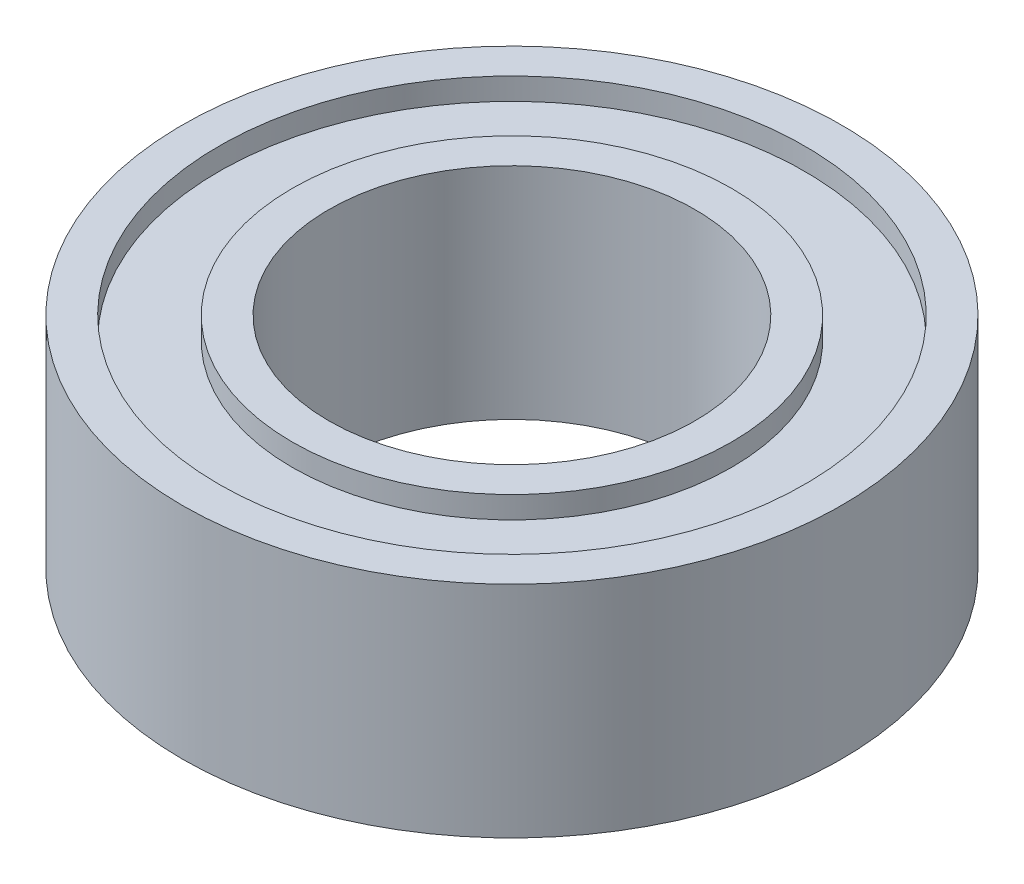
ISO-10303-21;
HEADER;
FILE_DESCRIPTION(('STEP AP214'),'2;1');
FILE_NAME('part.step','',(''),(''),'','','');
FILE_SCHEMA(('AUTOMOTIVE_DESIGN { 1 0 10303 214 1 1 1 1 }'));
ENDSEC;
DATA;
#1=APPLICATION_CONTEXT('core data for automotive mechanical design processes');
#2=APPLICATION_PROTOCOL_DEFINITION('international standard','automotive_design',2000,#1);
#3=PRODUCT_CONTEXT('',#1,'mechanical');
#4=PRODUCT('Part','Part','',(#3));
#5=PRODUCT_RELATED_PRODUCT_CATEGORY('part','',(#4));
#6=PRODUCT_DEFINITION_FORMATION('','',#4);
#7=PRODUCT_DEFINITION_CONTEXT('part definition',#1,'design');
#8=PRODUCT_DEFINITION('design','',#6,#7);
#9=PRODUCT_DEFINITION_SHAPE('','',#8);
#10=(LENGTH_UNIT() NAMED_UNIT(*) SI_UNIT(.MILLI.,.METRE.));
#11=(NAMED_UNIT(*) PLANE_ANGLE_UNIT() SI_UNIT($,.RADIAN.));
#12=(NAMED_UNIT(*) SI_UNIT($,.STERADIAN.) SOLID_ANGLE_UNIT());
#13=UNCERTAINTY_MEASURE_WITH_UNIT(LENGTH_MEASURE(1.E-05),#10,'distance_accuracy_value','');
#14=(GEOMETRIC_REPRESENTATION_CONTEXT(3) GLOBAL_UNCERTAINTY_ASSIGNED_CONTEXT((#13)) GLOBAL_UNIT_ASSIGNED_CONTEXT((#10,
#11,#12)) REPRESENTATION_CONTEXT('',''));
#15=CARTESIAN_POINT('',(0.,0.,0.));
#16=DIRECTION('',(0.,0.,1.));
#17=DIRECTION('',(1.,0.,0.));
#18=AXIS2_PLACEMENT_3D('',#15,#16,#17);
#19=CARTESIAN_POINT('',(0.,-1.5,0.));
#20=DIRECTION('',(0.,1.,0.));
#21=DIRECTION('',(0.,0.,1.));
#22=AXIS2_PLACEMENT_3D('',#19,#20,#21);
#23=CYLINDRICAL_SURFACE('',#22,4.);
#24=CARTESIAN_POINT('',(0.,-1.5,0.));
#25=DIRECTION('',(0.,1.,0.));
#26=DIRECTION('',(0.,0.,1.));
#27=AXIS2_PLACEMENT_3D('',#24,#25,#26);
#28=CIRCLE('',#27,4.);
#29=CARTESIAN_POINT('',(0.,-1.5,4.));
#30=VERTEX_POINT('',#29);
#31=EDGE_CURVE('E60',#30,#30,#28,.T.);
#32=ORIENTED_EDGE('',*,*,#31,.F.);
#33=EDGE_LOOP('',(#32));
#34=FACE_BOUND('',#33,.T.);
#35=CARTESIAN_POINT('',(0.,-1.2,0.));
#36=DIRECTION('',(0.,1.,0.));
#37=DIRECTION('',(0.,0.,1.));
#38=AXIS2_PLACEMENT_3D('',#35,#36,#37);
#39=CIRCLE('',#38,4.);
#40=CARTESIAN_POINT('',(0.,-1.2,4.));
#41=VERTEX_POINT('',#40);
#42=EDGE_CURVE('E11',#41,#41,#39,.F.);
#43=ORIENTED_EDGE('',*,*,#42,.F.);
#44=EDGE_LOOP('',(#43));
#45=FACE_BOUND('',#44,.T.);
#46=ADVANCED_FACE('F49',(#34,#45),#23,.F.);
#47=CARTESIAN_POINT('',(0.,1.2,0.));
#48=DIRECTION('',(0.,1.,0.));
#49=DIRECTION('',(0.,0.,1.));
#50=AXIS2_PLACEMENT_3D('',#47,#48,#49);
#51=CIRCLE('',#50,4.);
#52=CARTESIAN_POINT('',(0.,1.2,4.));
#53=VERTEX_POINT('',#52);
#54=EDGE_CURVE('E72',#53,#53,#51,.T.);
#55=ORIENTED_EDGE('',*,*,#54,.F.);
#56=EDGE_LOOP('',(#55));
#57=FACE_BOUND('',#56,.T.);
#58=CARTESIAN_POINT('',(0.,1.5,0.));
#59=DIRECTION('',(0.,1.,0.));
#60=DIRECTION('',(0.,0.,1.));
#61=AXIS2_PLACEMENT_3D('',#58,#59,#60);
#62=CIRCLE('',#61,4.);
#63=CARTESIAN_POINT('',(0.,1.5,4.));
#64=VERTEX_POINT('',#63);
#65=EDGE_CURVE('E69',#64,#64,#62,.T.);
#66=ORIENTED_EDGE('',*,*,#65,.T.);
#67=EDGE_LOOP('',(#66));
#68=FACE_BOUND('',#67,.T.);
#69=ADVANCED_FACE('F51',(#57,#68),#23,.F.);
#70=CARTESIAN_POINT('',(0.,-1.5,0.));
#71=DIRECTION('',(0.,1.,0.));
#72=DIRECTION('',(0.,0.,1.));
#73=AXIS2_PLACEMENT_3D('',#70,#71,#72);
#74=CYLINDRICAL_SURFACE('',#73,4.5);
#75=CARTESIAN_POINT('',(0.,-1.5,0.));
#76=DIRECTION('',(0.,1.,0.));
#77=DIRECTION('',(0.,0.,1.));
#78=AXIS2_PLACEMENT_3D('',#75,#76,#77);
#79=CIRCLE('',#78,4.5);
#80=CARTESIAN_POINT('',(0.,-1.5,4.5));
#81=VERTEX_POINT('',#80);
#82=EDGE_CURVE('E56',#81,#81,#79,.T.);
#83=ORIENTED_EDGE('',*,*,#82,.T.);
#84=EDGE_LOOP('',(#83));
#85=FACE_BOUND('',#84,.T.);
#86=CARTESIAN_POINT('',(0.,1.5,0.));
#87=DIRECTION('',(0.,1.,0.));
#88=DIRECTION('',(0.,0.,1.));
#89=AXIS2_PLACEMENT_3D('',#86,#87,#88);
#90=CIRCLE('',#89,4.5);
#91=CARTESIAN_POINT('',(0.,1.5,4.5));
#92=VERTEX_POINT('',#91);
#93=EDGE_CURVE('E64',#92,#92,#90,.T.);
#94=ORIENTED_EDGE('',*,*,#93,.F.);
#95=EDGE_LOOP('',(#94));
#96=FACE_BOUND('',#95,.T.);
#97=ADVANCED_FACE('F124',(#85,#96),#74,.T.);
#98=CARTESIAN_POINT('',(0.,-1.5,0.));
#99=DIRECTION('',(0.,1.,0.));
#100=DIRECTION('',(0.,0.,1.));
#101=AXIS2_PLACEMENT_3D('',#98,#99,#100);
#102=PLANE('',#101);
#103=ORIENTED_EDGE('',*,*,#31,.T.);
#104=EDGE_LOOP('',(#103));
#105=FACE_BOUND('',#104,.T.);
#106=ORIENTED_EDGE('',*,*,#82,.F.);
#107=EDGE_LOOP('',(#106));
#108=FACE_BOUND('',#107,.T.);
#109=ADVANCED_FACE('F129',(#105,#108),#102,.F.);
#110=CARTESIAN_POINT('',(0.,1.5,0.));
#111=DIRECTION('',(0.,1.,0.));
#112=DIRECTION('',(0.,0.,1.));
#113=AXIS2_PLACEMENT_3D('',#110,#111,#112);
#114=PLANE('',#113);
#115=ORIENTED_EDGE('',*,*,#65,.F.);
#116=EDGE_LOOP('',(#115));
#117=FACE_BOUND('',#116,.T.);
#118=ORIENTED_EDGE('',*,*,#93,.T.);
#119=EDGE_LOOP('',(#118));
#120=FACE_BOUND('',#119,.T.);
#121=ADVANCED_FACE('F132',(#117,#120),#114,.T.);
#122=CARTESIAN_POINT('',(0.,-1.2,0.));
#123=DIRECTION('',(0.,1.,0.));
#124=DIRECTION('',(0.,0.,1.));
#125=AXIS2_PLACEMENT_3D('',#122,#123,#124);
#126=PLANE('',#125);
#127=CARTESIAN_POINT('',(0.,-1.2,0.));
#128=DIRECTION('',(0.,1.,0.));
#129=DIRECTION('',(0.,0.,1.));
#130=AXIS2_PLACEMENT_3D('',#127,#128,#129);
#131=CIRCLE('',#130,3.);
#132=CARTESIAN_POINT('',(0.,-1.2,3.));
#133=VERTEX_POINT('',#132);
#134=EDGE_CURVE('E78',#133,#133,#131,.T.);
#135=ORIENTED_EDGE('',*,*,#134,.T.);
#136=EDGE_LOOP('',(#135));
#137=FACE_BOUND('',#136,.T.);
#138=ORIENTED_EDGE('',*,*,#42,.T.);
#139=EDGE_LOOP('',(#138));
#140=FACE_BOUND('',#139,.T.);
#141=ADVANCED_FACE('F138',(#137,#140),#126,.F.);
#142=CARTESIAN_POINT('',(0.,1.2,0.));
#143=DIRECTION('',(0.,1.,0.));
#144=DIRECTION('',(0.,0.,1.));
#145=AXIS2_PLACEMENT_3D('',#142,#143,#144);
#146=PLANE('',#145);
#147=ORIENTED_EDGE('',*,*,#54,.T.);
#148=EDGE_LOOP('',(#147));
#149=FACE_BOUND('',#148,.T.);
#150=CARTESIAN_POINT('',(0.,1.2,0.));
#151=DIRECTION('',(0.,1.,0.));
#152=DIRECTION('',(0.,0.,1.));
#153=AXIS2_PLACEMENT_3D('',#150,#151,#152);
#154=CIRCLE('',#153,3.);
#155=CARTESIAN_POINT('',(0.,1.2,3.));
#156=VERTEX_POINT('',#155);
#157=EDGE_CURVE('E75',#156,#156,#154,.T.);
#158=ORIENTED_EDGE('',*,*,#157,.F.);
#159=EDGE_LOOP('',(#158));
#160=FACE_BOUND('',#159,.T.);
#161=ADVANCED_FACE('F117',(#149,#160),#146,.T.);
#162=CARTESIAN_POINT('',(0.,-1.5,0.));
#163=DIRECTION('',(0.,1.,0.));
#164=DIRECTION('',(0.,0.,1.));
#165=AXIS2_PLACEMENT_3D('',#162,#163,#164);
#166=CYLINDRICAL_SURFACE('',#165,3.);
#167=CARTESIAN_POINT('',(0.,-1.5,0.));
#168=DIRECTION('',(0.,1.,0.));
#169=DIRECTION('',(0.,0.,1.));
#170=AXIS2_PLACEMENT_3D('',#167,#168,#169);
#171=CIRCLE('',#170,3.);
#172=CARTESIAN_POINT('',(0.,-1.5,3.));
#173=VERTEX_POINT('',#172);
#174=EDGE_CURVE('E81',#173,#173,#171,.T.);
#175=ORIENTED_EDGE('',*,*,#174,.T.);
#176=EDGE_LOOP('',(#175));
#177=FACE_BOUND('',#176,.T.);
#178=ORIENTED_EDGE('',*,*,#134,.F.);
#179=EDGE_LOOP('',(#178));
#180=FACE_BOUND('',#179,.T.);
#181=ADVANCED_FACE('F107',(#177,#180),#166,.T.);
#182=CARTESIAN_POINT('',(0.,-1.5,0.));
#183=DIRECTION('',(0.,1.,0.));
#184=DIRECTION('',(0.,0.,1.));
#185=AXIS2_PLACEMENT_3D('',#182,#183,#184);
#186=CYLINDRICAL_SURFACE('',#185,2.5);
#187=CARTESIAN_POINT('',(0.,-1.5,0.));
#188=DIRECTION('',(0.,1.,0.));
#189=DIRECTION('',(0.,0.,1.));
#190=AXIS2_PLACEMENT_3D('',#187,#188,#189);
#191=CIRCLE('',#190,2.5);
#192=CARTESIAN_POINT('',(0.,-1.5,2.5));
#193=VERTEX_POINT('',#192);
#194=EDGE_CURVE('E84',#193,#193,#191,.T.);
#195=ORIENTED_EDGE('',*,*,#194,.F.);
#196=EDGE_LOOP('',(#195));
#197=FACE_BOUND('',#196,.T.);
#198=CARTESIAN_POINT('',(0.,1.5,0.));
#199=DIRECTION('',(0.,1.,0.));
#200=DIRECTION('',(0.,0.,1.));
#201=AXIS2_PLACEMENT_3D('',#198,#199,#200);
#202=CIRCLE('',#201,2.5);
#203=CARTESIAN_POINT('',(0.,1.5,2.5));
#204=VERTEX_POINT('',#203);
#205=EDGE_CURVE('E90',#204,#204,#202,.T.);
#206=ORIENTED_EDGE('',*,*,#205,.T.);
#207=EDGE_LOOP('',(#206));
#208=FACE_BOUND('',#207,.T.);
#209=ADVANCED_FACE('F94',(#197,#208),#186,.F.);
#210=ORIENTED_EDGE('',*,*,#157,.T.);
#211=EDGE_LOOP('',(#210));
#212=FACE_BOUND('',#211,.T.);
#213=CARTESIAN_POINT('',(0.,1.5,0.));
#214=DIRECTION('',(0.,1.,0.));
#215=DIRECTION('',(0.,0.,1.));
#216=AXIS2_PLACEMENT_3D('',#213,#214,#215);
#217=CIRCLE('',#216,3.);
#218=CARTESIAN_POINT('',(0.,1.5,3.));
#219=VERTEX_POINT('',#218);
#220=EDGE_CURVE('E87',#219,#219,#217,.T.);
#221=ORIENTED_EDGE('',*,*,#220,.F.);
#222=EDGE_LOOP('',(#221));
#223=FACE_BOUND('',#222,.T.);
#224=ADVANCED_FACE('F103',(#212,#223),#166,.T.);
#225=CARTESIAN_POINT('',(0.,-1.5,0.));
#226=DIRECTION('',(0.,1.,0.));
#227=DIRECTION('',(0.,0.,1.));
#228=AXIS2_PLACEMENT_3D('',#225,#226,#227);
#229=PLANE('',#228);
#230=ORIENTED_EDGE('',*,*,#194,.T.);
#231=EDGE_LOOP('',(#230));
#232=FACE_BOUND('',#231,.T.);
#233=ORIENTED_EDGE('',*,*,#174,.F.);
#234=EDGE_LOOP('',(#233));
#235=FACE_BOUND('',#234,.T.);
#236=ADVANCED_FACE('F99',(#232,#235),#229,.F.);
#237=CARTESIAN_POINT('',(0.,1.5,0.));
#238=DIRECTION('',(0.,1.,0.));
#239=DIRECTION('',(0.,0.,1.));
#240=AXIS2_PLACEMENT_3D('',#237,#238,#239);
#241=PLANE('',#240);
#242=ORIENTED_EDGE('',*,*,#205,.F.);
#243=EDGE_LOOP('',(#242));
#244=FACE_BOUND('',#243,.T.);
#245=ORIENTED_EDGE('',*,*,#220,.T.);
#246=EDGE_LOOP('',(#245));
#247=FACE_BOUND('',#246,.T.);
#248=ADVANCED_FACE('F96',(#244,#247),#241,.T.);
#249=CLOSED_SHELL('',(#46,#69,#97,#109,#121,#141,#161,#181,#209,#224,#236,#248));
#250=MANIFOLD_SOLID_BREP('B2',#249);
#251=ADVANCED_BREP_SHAPE_REPRESENTATION('',(#18,#250),#14);
#252=SHAPE_DEFINITION_REPRESENTATION(#9,#251);
ENDSEC;
END-ISO-10303-21;
